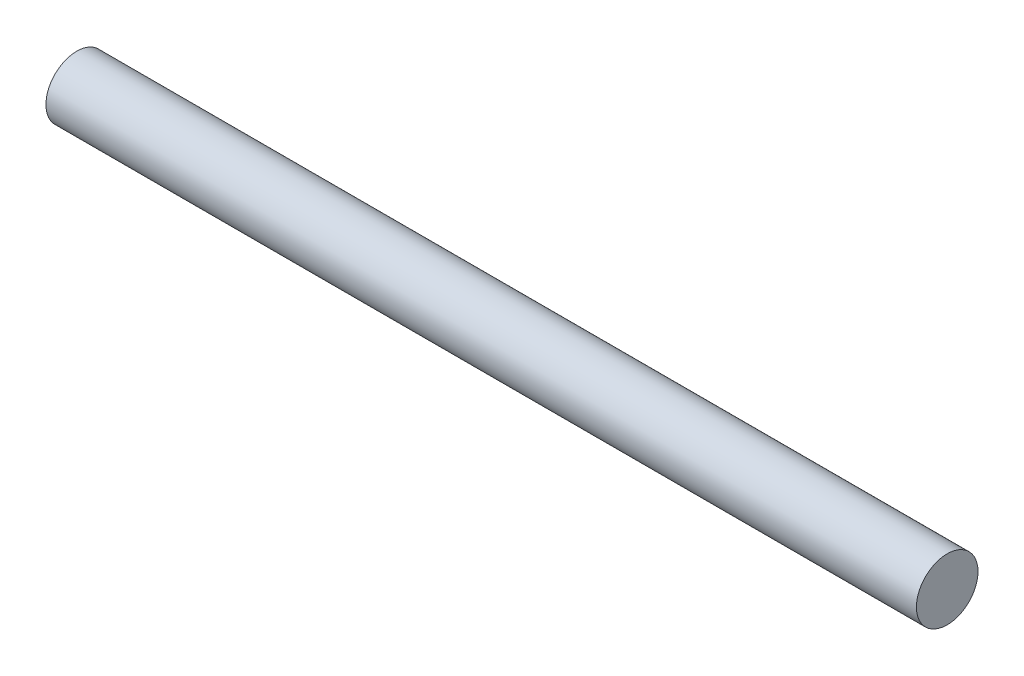
ISO-10303-21;
HEADER;
FILE_DESCRIPTION(('STEP AP214'),'2;1');
FILE_NAME('part.step','',(''),(''),'','','');
FILE_SCHEMA(('AUTOMOTIVE_DESIGN { 1 0 10303 214 1 1 1 1 }'));
ENDSEC;
DATA;
#1=APPLICATION_CONTEXT('core data for automotive mechanical design processes');
#2=APPLICATION_PROTOCOL_DEFINITION('international standard','automotive_design',2000,#1);
#3=PRODUCT_CONTEXT('',#1,'mechanical');
#4=PRODUCT('Part','Part','',(#3));
#5=PRODUCT_RELATED_PRODUCT_CATEGORY('part','',(#4));
#6=PRODUCT_DEFINITION_FORMATION('','',#4);
#7=PRODUCT_DEFINITION_CONTEXT('part definition',#1,'design');
#8=PRODUCT_DEFINITION('design','',#6,#7);
#9=PRODUCT_DEFINITION_SHAPE('','',#8);
#10=(LENGTH_UNIT() NAMED_UNIT(*) SI_UNIT(.MILLI.,.METRE.));
#11=(NAMED_UNIT(*) PLANE_ANGLE_UNIT() SI_UNIT($,.RADIAN.));
#12=(NAMED_UNIT(*) SI_UNIT($,.STERADIAN.) SOLID_ANGLE_UNIT());
#13=UNCERTAINTY_MEASURE_WITH_UNIT(LENGTH_MEASURE(1.E-05),#10,'distance_accuracy_value','');
#14=(GEOMETRIC_REPRESENTATION_CONTEXT(3) GLOBAL_UNCERTAINTY_ASSIGNED_CONTEXT((#13)) GLOBAL_UNIT_ASSIGNED_CONTEXT((#10,
#11,#12)) REPRESENTATION_CONTEXT('',''));
#15=CARTESIAN_POINT('',(0.,0.,0.));
#16=DIRECTION('',(0.,0.,1.));
#17=DIRECTION('',(1.,0.,0.));
#18=AXIS2_PLACEMENT_3D('',#15,#16,#17);
#19=CARTESIAN_POINT('',(33.02,0.,0.));
#20=DIRECTION('',(-1.,0.,0.));
#21=DIRECTION('',(0.,0.,1.));
#22=AXIS2_PLACEMENT_3D('',#19,#20,#21);
#23=CYLINDRICAL_SURFACE('',#22,1.1684);
#24=CARTESIAN_POINT('',(33.02,0.,0.));
#25=DIRECTION('',(1.,0.,0.));
#26=DIRECTION('',(0.,0.,-1.));
#27=AXIS2_PLACEMENT_3D('',#24,#25,#26);
#28=CIRCLE('',#27,1.1684);
#29=CARTESIAN_POINT('',(33.02,0.,-1.1684));
#30=VERTEX_POINT('',#29);
#31=EDGE_CURVE('E10',#30,#30,#28,.T.);
#32=ORIENTED_EDGE('',*,*,#31,.F.);
#33=EDGE_LOOP('',(#32));
#34=FACE_BOUND('',#33,.T.);
#35=CARTESIAN_POINT('',(0.,0.,0.));
#36=DIRECTION('',(1.,0.,0.));
#37=DIRECTION('',(0.,0.,-1.));
#38=AXIS2_PLACEMENT_3D('',#35,#36,#37);
#39=CIRCLE('',#38,1.1684);
#40=CARTESIAN_POINT('',(0.,0.,-1.1684));
#41=VERTEX_POINT('',#40);
#42=EDGE_CURVE('E34',#41,#41,#39,.T.);
#43=ORIENTED_EDGE('',*,*,#42,.T.);
#44=EDGE_LOOP('',(#43));
#45=FACE_BOUND('',#44,.T.);
#46=ADVANCED_FACE('F31',(#34,#45),#23,.T.);
#47=CARTESIAN_POINT('',(33.02,0.,0.));
#48=DIRECTION('',(1.,0.,0.));
#49=DIRECTION('',(0.,0.,-1.));
#50=AXIS2_PLACEMENT_3D('',#47,#48,#49);
#51=PLANE('',#50);
#52=ORIENTED_EDGE('',*,*,#31,.T.);
#53=EDGE_LOOP('',(#52));
#54=FACE_BOUND('',#53,.T.);
#55=ADVANCED_FACE('F46',(#54),#51,.T.);
#56=CARTESIAN_POINT('',(0.,0.,0.));
#57=DIRECTION('',(1.,0.,0.));
#58=DIRECTION('',(0.,0.,-1.));
#59=AXIS2_PLACEMENT_3D('',#56,#57,#58);
#60=PLANE('',#59);
#61=ORIENTED_EDGE('',*,*,#42,.F.);
#62=EDGE_LOOP('',(#61));
#63=FACE_BOUND('',#62,.T.);
#64=ADVANCED_FACE('F44',(#63),#60,.F.);
#65=CLOSED_SHELL('',(#46,#55,#64));
#66=MANIFOLD_SOLID_BREP('B2',#65);
#67=ADVANCED_BREP_SHAPE_REPRESENTATION('',(#18,#66),#14);
#68=SHAPE_DEFINITION_REPRESENTATION(#9,#67);
ENDSEC;
END-ISO-10303-21;
